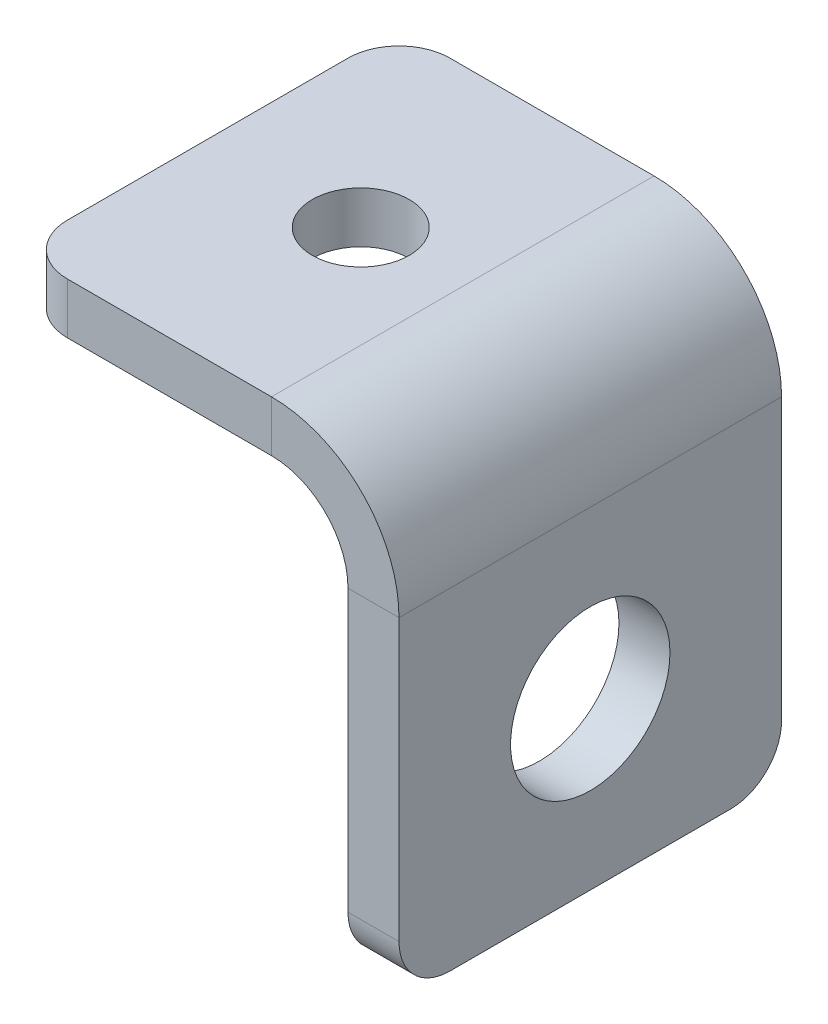
ISO-10303-21;
HEADER;
FILE_DESCRIPTION(('STEP AP214'),'2;1');
FILE_NAME('part.step','',(''),(''),'','','');
FILE_SCHEMA(('AUTOMOTIVE_DESIGN { 1 0 10303 214 1 1 1 1 }'));
ENDSEC;
DATA;
#1=APPLICATION_CONTEXT('core data for automotive mechanical design processes');
#2=APPLICATION_PROTOCOL_DEFINITION('international standard','automotive_design',2000,#1);
#3=PRODUCT_CONTEXT('',#1,'mechanical');
#4=PRODUCT('Part','Part','',(#3));
#5=PRODUCT_RELATED_PRODUCT_CATEGORY('part','',(#4));
#6=PRODUCT_DEFINITION_FORMATION('','',#4);
#7=PRODUCT_DEFINITION_CONTEXT('part definition',#1,'design');
#8=PRODUCT_DEFINITION('design','',#6,#7);
#9=PRODUCT_DEFINITION_SHAPE('','',#8);
#10=(LENGTH_UNIT() NAMED_UNIT(*) SI_UNIT(.MILLI.,.METRE.));
#11=(NAMED_UNIT(*) PLANE_ANGLE_UNIT() SI_UNIT($,.RADIAN.));
#12=(NAMED_UNIT(*) SI_UNIT($,.STERADIAN.) SOLID_ANGLE_UNIT());
#13=UNCERTAINTY_MEASURE_WITH_UNIT(LENGTH_MEASURE(1.E-05),#10,'distance_accuracy_value','');
#14=(GEOMETRIC_REPRESENTATION_CONTEXT(3) GLOBAL_UNCERTAINTY_ASSIGNED_CONTEXT((#13)) GLOBAL_UNIT_ASSIGNED_CONTEXT((#10,
#11,#12)) REPRESENTATION_CONTEXT('',''));
#15=CARTESIAN_POINT('',(0.,0.,0.));
#16=DIRECTION('',(0.,0.,1.));
#17=DIRECTION('',(1.,0.,0.));
#18=AXIS2_PLACEMENT_3D('',#15,#16,#17);
#19=CARTESIAN_POINT('',(2.54,0.,-6.985));
#20=DIRECTION('',(0.,-1.,0.));
#21=DIRECTION('',(0.,0.,-1.));
#22=AXIS2_PLACEMENT_3D('',#19,#20,#21);
#23=CYLINDRICAL_SURFACE('',#22,2.54);
#24=DIRECTION('',(0.,1.,0.));
#25=VECTOR('',#24,1.);
#26=CARTESIAN_POINT('',(2.54,0.,-9.525));
#27=LINE('',#26,#25);
#28=CARTESIAN_POINT('',(2.54,-2.54,-9.525));
#29=VERTEX_POINT('',#28);
#30=CARTESIAN_POINT('',(2.54,0.,-9.525));
#31=VERTEX_POINT('',#30);
#32=EDGE_CURVE('E11',#29,#31,#27,.T.);
#33=ORIENTED_EDGE('',*,*,#32,.F.);
#34=CARTESIAN_POINT('',(2.54,-2.54,-6.985));
#35=DIRECTION('',(0.,-1.,0.));
#36=DIRECTION('',(0.,0.,-1.));
#37=AXIS2_PLACEMENT_3D('',#34,#35,#36);
#38=CIRCLE('',#37,2.54);
#39=CARTESIAN_POINT('',(0.,-2.54,-6.98499999999999));
#40=VERTEX_POINT('',#39);
#41=EDGE_CURVE('E132',#29,#40,#38,.F.);
#42=ORIENTED_EDGE('',*,*,#41,.T.);
#43=DIRECTION('',(0.,1.,0.));
#44=VECTOR('',#43,1.);
#45=CARTESIAN_POINT('',(0.,0.,-6.98499999999999));
#46=LINE('',#45,#44);
#47=CARTESIAN_POINT('',(0.,0.,-6.98499999999999));
#48=VERTEX_POINT('',#47);
#49=EDGE_CURVE('E45',#40,#48,#46,.T.);
#50=ORIENTED_EDGE('',*,*,#49,.T.);
#51=CARTESIAN_POINT('',(2.54,0.,-6.985));
#52=DIRECTION('',(0.,-1.,0.));
#53=DIRECTION('',(0.,0.,-1.));
#54=AXIS2_PLACEMENT_3D('',#51,#52,#53);
#55=CIRCLE('',#54,2.54);
#56=EDGE_CURVE('E195',#31,#48,#55,.F.);
#57=ORIENTED_EDGE('',*,*,#56,.F.);
#58=EDGE_LOOP('',(#33,#42,#50,#57));
#59=FACE_BOUND('',#58,.T.);
#60=ADVANCED_FACE('F35',(#59),#23,.T.);
#61=CARTESIAN_POINT('',(0.,0.,9.525));
#62=DIRECTION('',(-1.,0.,0.));
#63=DIRECTION('',(0.,0.,-1.));
#64=AXIS2_PLACEMENT_3D('',#61,#62,#63);
#65=PLANE('',#64);
#66=ORIENTED_EDGE('',*,*,#49,.F.);
#67=DIRECTION('',(0.,0.,-1.));
#68=VECTOR('',#67,1.);
#69=CARTESIAN_POINT('',(0.,-2.54,9.525));
#70=LINE('',#69,#68);
#71=CARTESIAN_POINT('',(0.,-2.54,6.985));
#72=VERTEX_POINT('',#71);
#73=EDGE_CURVE('E161',#72,#40,#70,.T.);
#74=ORIENTED_EDGE('',*,*,#73,.F.);
#75=DIRECTION('',(0.,1.,0.));
#76=VECTOR('',#75,1.);
#77=CARTESIAN_POINT('',(0.,0.,6.985));
#78=LINE('',#77,#76);
#79=CARTESIAN_POINT('',(0.,0.,6.985));
#80=VERTEX_POINT('',#79);
#81=EDGE_CURVE('E188',#72,#80,#78,.T.);
#82=ORIENTED_EDGE('',*,*,#81,.T.);
#83=DIRECTION('',(0.,0.,-1.));
#84=VECTOR('',#83,1.);
#85=CARTESIAN_POINT('',(0.,0.,9.525));
#86=LINE('',#85,#84);
#87=EDGE_CURVE('E205',#80,#48,#86,.T.);
#88=ORIENTED_EDGE('',*,*,#87,.T.);
#89=EDGE_LOOP('',(#66,#74,#82,#88));
#90=FACE_BOUND('',#89,.T.);
#91=ADVANCED_FACE('F209',(#90),#65,.T.);
#92=CARTESIAN_POINT('',(2.54,0.,6.985));
#93=DIRECTION('',(0.,-1.,0.));
#94=DIRECTION('',(0.,0.,-1.));
#95=AXIS2_PLACEMENT_3D('',#92,#93,#94);
#96=CYLINDRICAL_SURFACE('',#95,2.54);
#97=ORIENTED_EDGE('',*,*,#81,.F.);
#98=CARTESIAN_POINT('',(2.54,-2.54,6.985));
#99=DIRECTION('',(0.,-1.,0.));
#100=DIRECTION('',(0.,0.,-1.));
#101=AXIS2_PLACEMENT_3D('',#98,#99,#100);
#102=CIRCLE('',#101,2.54);
#103=CARTESIAN_POINT('',(2.54,-2.54,9.525));
#104=VERTEX_POINT('',#103);
#105=EDGE_CURVE('E158',#72,#104,#102,.F.);
#106=ORIENTED_EDGE('',*,*,#105,.T.);
#107=DIRECTION('',(0.,1.,0.));
#108=VECTOR('',#107,1.);
#109=CARTESIAN_POINT('',(2.54,0.,9.525));
#110=LINE('',#109,#108);
#111=CARTESIAN_POINT('',(2.54,0.,9.525));
#112=VERTEX_POINT('',#111);
#113=EDGE_CURVE('E185',#104,#112,#110,.T.);
#114=ORIENTED_EDGE('',*,*,#113,.T.);
#115=CARTESIAN_POINT('',(2.54,0.,6.985));
#116=DIRECTION('',(0.,-1.,0.));
#117=DIRECTION('',(0.,0.,-1.));
#118=AXIS2_PLACEMENT_3D('',#115,#116,#117);
#119=CIRCLE('',#118,2.54);
#120=EDGE_CURVE('E210',#80,#112,#119,.F.);
#121=ORIENTED_EDGE('',*,*,#120,.F.);
#122=EDGE_LOOP('',(#97,#106,#114,#121));
#123=FACE_BOUND('',#122,.T.);
#124=ADVANCED_FACE('F298',(#123),#96,.T.);
#125=CARTESIAN_POINT('',(0.,0.,9.525));
#126=DIRECTION('',(0.,0.,1.));
#127=DIRECTION('',(-1.,0.,0.));
#128=AXIS2_PLACEMENT_3D('',#125,#126,#127);
#129=PLANE('',#128);
#130=ORIENTED_EDGE('',*,*,#113,.F.);
#131=DIRECTION('',(1.,0.,0.));
#132=VECTOR('',#131,1.);
#133=CARTESIAN_POINT('',(0.,-2.54,9.525));
#134=LINE('',#133,#132);
#135=CARTESIAN_POINT('',(12.7,-2.54,9.525));
#136=VERTEX_POINT('',#135);
#137=EDGE_CURVE('E128',#136,#104,#134,.F.);
#138=ORIENTED_EDGE('',*,*,#137,.F.);
#139=DIRECTION('',(0.,1.,0.));
#140=VECTOR('',#139,1.);
#141=CARTESIAN_POINT('',(12.7,0.,9.525));
#142=LINE('',#141,#140);
#143=CARTESIAN_POINT('',(12.7,0.,9.525));
#144=VERTEX_POINT('',#143);
#145=EDGE_CURVE('E182',#136,#144,#142,.T.);
#146=ORIENTED_EDGE('',*,*,#145,.T.);
#147=DIRECTION('',(-1.,0.,0.));
#148=VECTOR('',#147,1.);
#149=CARTESIAN_POINT('',(0.,0.,9.525));
#150=LINE('',#149,#148);
#151=EDGE_CURVE('E212',#144,#112,#150,.T.);
#152=ORIENTED_EDGE('',*,*,#151,.T.);
#153=EDGE_LOOP('',(#130,#138,#146,#152));
#154=FACE_BOUND('',#153,.T.);
#155=ADVANCED_FACE('F427',(#154),#129,.T.);
#156=CARTESIAN_POINT('',(12.7,-6.35,9.525));
#157=DIRECTION('',(0.,0.,-1.));
#158=DIRECTION('',(-1.,0.,0.));
#159=AXIS2_PLACEMENT_3D('',#156,#157,#158);
#160=PLANE('',#159);
#161=ORIENTED_EDGE('',*,*,#145,.F.);
#162=CARTESIAN_POINT('',(12.7,-6.35,9.525));
#163=DIRECTION('',(0.,0.,-1.));
#164=DIRECTION('',(-1.,0.,0.));
#165=AXIS2_PLACEMENT_3D('',#162,#163,#164);
#166=CIRCLE('',#165,3.81);
#167=CARTESIAN_POINT('',(16.51,-6.35,9.525));
#168=VERTEX_POINT('',#167);
#169=EDGE_CURVE('E124',#168,#136,#166,.F.);
#170=ORIENTED_EDGE('',*,*,#169,.F.);
#171=DIRECTION('',(1.,0.,0.));
#172=VECTOR('',#171,1.);
#173=CARTESIAN_POINT('',(19.05,-6.35,9.525));
#174=LINE('',#173,#172);
#175=CARTESIAN_POINT('',(19.05,-6.35,9.525));
#176=VERTEX_POINT('',#175);
#177=EDGE_CURVE('E179',#168,#176,#174,.T.);
#178=ORIENTED_EDGE('',*,*,#177,.T.);
#179=CARTESIAN_POINT('',(12.7,-6.35,9.525));
#180=DIRECTION('',(0.,0.,1.));
#181=DIRECTION('',(-1.,0.,0.));
#182=AXIS2_PLACEMENT_3D('',#179,#180,#181);
#183=CIRCLE('',#182,6.35);
#184=EDGE_CURVE('E113',#176,#144,#183,.T.);
#185=ORIENTED_EDGE('',*,*,#184,.T.);
#186=EDGE_LOOP('',(#161,#170,#178,#185));
#187=FACE_BOUND('',#186,.T.);
#188=ADVANCED_FACE('F248',(#187),#160,.F.);
#189=CARTESIAN_POINT('',(19.05,-6.35,9.525));
#190=DIRECTION('',(0.,0.,1.));
#191=DIRECTION('',(0.,1.,0.));
#192=AXIS2_PLACEMENT_3D('',#189,#190,#191);
#193=PLANE('',#192);
#194=ORIENTED_EDGE('',*,*,#177,.F.);
#195=DIRECTION('',(0.,1.,0.));
#196=VECTOR('',#195,1.);
#197=CARTESIAN_POINT('',(16.51,-6.35,9.525));
#198=LINE('',#197,#196);
#199=CARTESIAN_POINT('',(16.51,-20.32,9.525));
#200=VERTEX_POINT('',#199);
#201=EDGE_CURVE('E141',#200,#168,#198,.T.);
#202=ORIENTED_EDGE('',*,*,#201,.F.);
#203=DIRECTION('',(1.,0.,0.));
#204=VECTOR('',#203,1.);
#205=CARTESIAN_POINT('',(19.05,-20.32,9.525));
#206=LINE('',#205,#204);
#207=CARTESIAN_POINT('',(19.05,-20.32,9.525));
#208=VERTEX_POINT('',#207);
#209=EDGE_CURVE('E177',#200,#208,#206,.T.);
#210=ORIENTED_EDGE('',*,*,#209,.T.);
#211=DIRECTION('',(0.,1.,0.));
#212=VECTOR('',#211,1.);
#213=CARTESIAN_POINT('',(19.05,-6.35,9.525));
#214=LINE('',#213,#212);
#215=EDGE_CURVE('E236',#208,#176,#214,.T.);
#216=ORIENTED_EDGE('',*,*,#215,.T.);
#217=EDGE_LOOP('',(#194,#202,#210,#216));
#218=FACE_BOUND('',#217,.T.);
#219=ADVANCED_FACE('F281',(#218),#193,.T.);
#220=CARTESIAN_POINT('',(19.05,-20.32,6.985));
#221=DIRECTION('',(-1.,0.,0.));
#222=DIRECTION('',(0.,0.,1.));
#223=AXIS2_PLACEMENT_3D('',#220,#221,#222);
#224=CYLINDRICAL_SURFACE('',#223,2.54);
#225=ORIENTED_EDGE('',*,*,#209,.F.);
#226=CARTESIAN_POINT('',(16.51,-20.32,6.985));
#227=DIRECTION('',(-1.,0.,0.));
#228=DIRECTION('',(0.,0.,1.));
#229=AXIS2_PLACEMENT_3D('',#226,#227,#228);
#230=CIRCLE('',#229,2.54);
#231=CARTESIAN_POINT('',(16.51,-22.86,6.985));
#232=VERTEX_POINT('',#231);
#233=EDGE_CURVE('E137',#200,#232,#230,.F.);
#234=ORIENTED_EDGE('',*,*,#233,.T.);
#235=DIRECTION('',(1.,0.,0.));
#236=VECTOR('',#235,1.);
#237=CARTESIAN_POINT('',(19.05,-22.86,6.985));
#238=LINE('',#237,#236);
#239=CARTESIAN_POINT('',(19.05,-22.86,6.985));
#240=VERTEX_POINT('',#239);
#241=EDGE_CURVE('E53',#232,#240,#238,.T.);
#242=ORIENTED_EDGE('',*,*,#241,.T.);
#243=CARTESIAN_POINT('',(19.05,-20.32,6.985));
#244=DIRECTION('',(-1.,0.,0.));
#245=DIRECTION('',(0.,0.,1.));
#246=AXIS2_PLACEMENT_3D('',#243,#244,#245);
#247=CIRCLE('',#246,2.54);
#248=EDGE_CURVE('E239',#208,#240,#247,.F.);
#249=ORIENTED_EDGE('',*,*,#248,.F.);
#250=EDGE_LOOP('',(#225,#234,#242,#249));
#251=FACE_BOUND('',#250,.T.);
#252=ADVANCED_FACE('F282',(#251),#224,.T.);
#253=CARTESIAN_POINT('',(19.05,-22.86,9.525));
#254=DIRECTION('',(0.,1.,0.));
#255=DIRECTION('',(0.,0.,-1.));
#256=AXIS2_PLACEMENT_3D('',#253,#254,#255);
#257=PLANE('',#256);
#258=ORIENTED_EDGE('',*,*,#241,.F.);
#259=DIRECTION('',(0.,0.,1.));
#260=VECTOR('',#259,1.);
#261=CARTESIAN_POINT('',(16.51,-22.86,9.525));
#262=LINE('',#261,#260);
#263=CARTESIAN_POINT('',(16.51,-22.86,-6.98499999999999));
#264=VERTEX_POINT('',#263);
#265=EDGE_CURVE('E151',#232,#264,#262,.F.);
#266=ORIENTED_EDGE('',*,*,#265,.T.);
#267=DIRECTION('',(1.,0.,0.));
#268=VECTOR('',#267,1.);
#269=CARTESIAN_POINT('',(19.05,-22.86,-6.98499999999999));
#270=LINE('',#269,#268);
#271=CARTESIAN_POINT('',(19.05,-22.86,-6.98499999999999));
#272=VERTEX_POINT('',#271);
#273=EDGE_CURVE('E173',#264,#272,#270,.T.);
#274=ORIENTED_EDGE('',*,*,#273,.T.);
#275=DIRECTION('',(0.,0.,-1.));
#276=VECTOR('',#275,1.);
#277=CARTESIAN_POINT('',(19.05,-22.86,9.525));
#278=LINE('',#277,#276);
#279=EDGE_CURVE('E224',#240,#272,#278,.T.);
#280=ORIENTED_EDGE('',*,*,#279,.F.);
#281=EDGE_LOOP('',(#258,#266,#274,#280));
#282=FACE_BOUND('',#281,.T.);
#283=ADVANCED_FACE('F284',(#282),#257,.F.);
#284=CARTESIAN_POINT('',(19.05,-20.32,-6.985));
#285=DIRECTION('',(-1.,0.,0.));
#286=DIRECTION('',(0.,0.,1.));
#287=AXIS2_PLACEMENT_3D('',#284,#285,#286);
#288=CYLINDRICAL_SURFACE('',#287,2.54);
#289=ORIENTED_EDGE('',*,*,#273,.F.);
#290=CARTESIAN_POINT('',(16.51,-20.32,-6.985));
#291=DIRECTION('',(-1.,0.,0.));
#292=DIRECTION('',(0.,0.,1.));
#293=AXIS2_PLACEMENT_3D('',#290,#291,#292);
#294=CIRCLE('',#293,2.54);
#295=CARTESIAN_POINT('',(16.51,-20.32,-9.525));
#296=VERTEX_POINT('',#295);
#297=EDGE_CURVE('E148',#264,#296,#294,.F.);
#298=ORIENTED_EDGE('',*,*,#297,.T.);
#299=DIRECTION('',(1.,0.,0.));
#300=VECTOR('',#299,1.);
#301=CARTESIAN_POINT('',(19.05,-20.32,-9.525));
#302=LINE('',#301,#300);
#303=CARTESIAN_POINT('',(19.05,-20.32,-9.525));
#304=VERTEX_POINT('',#303);
#305=EDGE_CURVE('E170',#296,#304,#302,.T.);
#306=ORIENTED_EDGE('',*,*,#305,.T.);
#307=CARTESIAN_POINT('',(19.05,-20.32,-6.985));
#308=DIRECTION('',(-1.,0.,0.));
#309=DIRECTION('',(0.,0.,1.));
#310=AXIS2_PLACEMENT_3D('',#307,#308,#309);
#311=CIRCLE('',#310,2.54);
#312=EDGE_CURVE('E227',#272,#304,#311,.F.);
#313=ORIENTED_EDGE('',*,*,#312,.F.);
#314=EDGE_LOOP('',(#289,#298,#306,#313));
#315=FACE_BOUND('',#314,.T.);
#316=ADVANCED_FACE('F273',(#315),#288,.T.);
#317=CARTESIAN_POINT('',(19.05,-6.35,-9.525));
#318=DIRECTION('',(0.,0.,1.));
#319=DIRECTION('',(0.,1.,0.));
#320=AXIS2_PLACEMENT_3D('',#317,#318,#319);
#321=PLANE('',#320);
#322=ORIENTED_EDGE('',*,*,#305,.F.);
#323=DIRECTION('',(0.,1.,0.));
#324=VECTOR('',#323,1.);
#325=CARTESIAN_POINT('',(16.51,-6.35,-9.525));
#326=LINE('',#325,#324);
#327=CARTESIAN_POINT('',(16.51,-6.35,-9.525));
#328=VERTEX_POINT('',#327);
#329=EDGE_CURVE('E146',#296,#328,#326,.T.);
#330=ORIENTED_EDGE('',*,*,#329,.T.);
#331=DIRECTION('',(1.,0.,0.));
#332=VECTOR('',#331,1.);
#333=CARTESIAN_POINT('',(19.05,-6.35,-9.525));
#334=LINE('',#333,#332);
#335=CARTESIAN_POINT('',(19.05,-6.35,-9.525));
#336=VERTEX_POINT('',#335);
#337=EDGE_CURVE('E112',#328,#336,#334,.T.);
#338=ORIENTED_EDGE('',*,*,#337,.T.);
#339=DIRECTION('',(0.,1.,0.));
#340=VECTOR('',#339,1.);
#341=CARTESIAN_POINT('',(19.05,-6.35,-9.525));
#342=LINE('',#341,#340);
#343=EDGE_CURVE('E230',#304,#336,#342,.T.);
#344=ORIENTED_EDGE('',*,*,#343,.F.);
#345=EDGE_LOOP('',(#322,#330,#338,#344));
#346=FACE_BOUND('',#345,.T.);
#347=ADVANCED_FACE('F265',(#346),#321,.F.);
#348=CARTESIAN_POINT('',(12.7,-6.35,-9.525));
#349=DIRECTION('',(0.,0.,-1.));
#350=DIRECTION('',(-1.,0.,0.));
#351=AXIS2_PLACEMENT_3D('',#348,#349,#350);
#352=PLANE('',#351);
#353=ORIENTED_EDGE('',*,*,#337,.F.);
#354=CARTESIAN_POINT('',(12.7,-6.35,-9.52499999999999));
#355=DIRECTION('',(0.,0.,-1.));
#356=DIRECTION('',(-1.,0.,0.));
#357=AXIS2_PLACEMENT_3D('',#354,#355,#356);
#358=CIRCLE('',#357,3.81);
#359=CARTESIAN_POINT('',(12.7,-2.54,-9.525));
#360=VERTEX_POINT('',#359);
#361=EDGE_CURVE('E121',#328,#360,#358,.F.);
#362=ORIENTED_EDGE('',*,*,#361,.T.);
#363=DIRECTION('',(0.,1.,0.));
#364=VECTOR('',#363,1.);
#365=CARTESIAN_POINT('',(12.7,0.,-9.525));
#366=LINE('',#365,#364);
#367=CARTESIAN_POINT('',(12.7,0.,-9.525));
#368=VERTEX_POINT('',#367);
#369=EDGE_CURVE('E39',#360,#368,#366,.T.);
#370=ORIENTED_EDGE('',*,*,#369,.T.);
#371=CARTESIAN_POINT('',(12.7,-6.35,-9.525));
#372=DIRECTION('',(0.,0.,1.));
#373=DIRECTION('',(-1.,0.,0.));
#374=AXIS2_PLACEMENT_3D('',#371,#372,#373);
#375=CIRCLE('',#374,6.35);
#376=EDGE_CURVE('E241',#336,#368,#375,.T.);
#377=ORIENTED_EDGE('',*,*,#376,.F.);
#378=EDGE_LOOP('',(#353,#362,#370,#377));
#379=FACE_BOUND('',#378,.T.);
#380=ADVANCED_FACE('F134',(#379),#352,.T.);
#381=CARTESIAN_POINT('',(7.62,0.,0.));
#382=DIRECTION('',(0.,1.,0.));
#383=DIRECTION('',(0.,0.,1.));
#384=AXIS2_PLACEMENT_3D('',#381,#382,#383);
#385=CYLINDRICAL_SURFACE('',#384,2.413);
#386=CARTESIAN_POINT('',(7.62,0.,0.));
#387=DIRECTION('',(0.,1.,0.));
#388=DIRECTION('',(0.,0.,1.));
#389=AXIS2_PLACEMENT_3D('',#386,#387,#388);
#390=CIRCLE('',#389,2.413);
#391=CARTESIAN_POINT('',(7.62,0.,2.413));
#392=VERTEX_POINT('',#391);
#393=EDGE_CURVE('E139',#392,#392,#390,.T.);
#394=ORIENTED_EDGE('',*,*,#393,.T.);
#395=EDGE_LOOP('',(#394));
#396=FACE_BOUND('',#395,.T.);
#397=CARTESIAN_POINT('',(7.62,-2.54,0.));
#398=DIRECTION('',(0.,1.,0.));
#399=DIRECTION('',(0.,0.,1.));
#400=AXIS2_PLACEMENT_3D('',#397,#398,#399);
#401=CIRCLE('',#400,2.413);
#402=CARTESIAN_POINT('',(7.62,-2.54,2.413));
#403=VERTEX_POINT('',#402);
#404=EDGE_CURVE('E163',#403,#403,#401,.T.);
#405=ORIENTED_EDGE('',*,*,#404,.F.);
#406=EDGE_LOOP('',(#405));
#407=FACE_BOUND('',#406,.T.);
#408=ADVANCED_FACE('F37',(#396,#407),#385,.F.);
#409=CARTESIAN_POINT('',(19.05,-14.605,0.));
#410=DIRECTION('',(1.,0.,0.));
#411=DIRECTION('',(0.,0.,-1.));
#412=AXIS2_PLACEMENT_3D('',#409,#410,#411);
#413=CYLINDRICAL_SURFACE('',#412,3.96875);
#414=CARTESIAN_POINT('',(19.05,-14.605,0.));
#415=DIRECTION('',(1.,0.,0.));
#416=DIRECTION('',(0.,0.,-1.));
#417=AXIS2_PLACEMENT_3D('',#414,#415,#416);
#418=CIRCLE('',#417,3.96875);
#419=CARTESIAN_POINT('',(19.05,-14.605,-3.96875));
#420=VERTEX_POINT('',#419);
#421=EDGE_CURVE('E207',#420,#420,#418,.T.);
#422=ORIENTED_EDGE('',*,*,#421,.T.);
#423=EDGE_LOOP('',(#422));
#424=FACE_BOUND('',#423,.T.);
#425=CARTESIAN_POINT('',(16.51,-14.605,0.));
#426=DIRECTION('',(1.,0.,0.));
#427=DIRECTION('',(0.,0.,-1.));
#428=AXIS2_PLACEMENT_3D('',#425,#426,#427);
#429=CIRCLE('',#428,3.96875);
#430=CARTESIAN_POINT('',(16.51,-14.605,-3.96875));
#431=VERTEX_POINT('',#430);
#432=EDGE_CURVE('E153',#431,#431,#429,.T.);
#433=ORIENTED_EDGE('',*,*,#432,.F.);
#434=EDGE_LOOP('',(#433));
#435=FACE_BOUND('',#434,.T.);
#436=ADVANCED_FACE('F303',(#424,#435),#413,.F.);
#437=CARTESIAN_POINT('',(0.,0.,-9.525));
#438=DIRECTION('',(0.,0.,1.));
#439=DIRECTION('',(-1.,0.,0.));
#440=AXIS2_PLACEMENT_3D('',#437,#438,#439);
#441=PLANE('',#440);
#442=DIRECTION('',(1.,0.,0.));
#443=VECTOR('',#442,1.);
#444=CARTESIAN_POINT('',(0.,-2.54,-9.525));
#445=LINE('',#444,#443);
#446=EDGE_CURVE('E103',#360,#29,#445,.F.);
#447=ORIENTED_EDGE('',*,*,#446,.T.);
#448=ORIENTED_EDGE('',*,*,#32,.T.);
#449=DIRECTION('',(-1.,0.,0.));
#450=VECTOR('',#449,1.);
#451=CARTESIAN_POINT('',(0.,0.,-9.525));
#452=LINE('',#451,#450);
#453=EDGE_CURVE('E106',#368,#31,#452,.T.);
#454=ORIENTED_EDGE('',*,*,#453,.F.);
#455=ORIENTED_EDGE('',*,*,#369,.F.);
#456=EDGE_LOOP('',(#447,#448,#454,#455));
#457=FACE_BOUND('',#456,.T.);
#458=ADVANCED_FACE('F101',(#457),#441,.F.);
#459=CARTESIAN_POINT('',(12.7,-6.35,9.525));
#460=DIRECTION('',(0.,0.,-1.));
#461=DIRECTION('',(-1.,0.,0.));
#462=AXIS2_PLACEMENT_3D('',#459,#460,#461);
#463=CYLINDRICAL_SURFACE('',#462,6.35);
#464=ORIENTED_EDGE('',*,*,#376,.T.);
#465=DIRECTION('',(0.,0.,-1.));
#466=VECTOR('',#465,1.);
#467=CARTESIAN_POINT('',(12.7,0.,9.525));
#468=LINE('',#467,#466);
#469=EDGE_CURVE('E219',#144,#368,#468,.T.);
#470=ORIENTED_EDGE('',*,*,#469,.F.);
#471=ORIENTED_EDGE('',*,*,#184,.F.);
#472=DIRECTION('',(0.,0.,-1.));
#473=VECTOR('',#472,1.);
#474=CARTESIAN_POINT('',(19.05,-6.35,9.525));
#475=LINE('',#474,#473);
#476=EDGE_CURVE('E233',#176,#336,#475,.T.);
#477=ORIENTED_EDGE('',*,*,#476,.T.);
#478=EDGE_LOOP('',(#464,#470,#471,#477));
#479=FACE_BOUND('',#478,.T.);
#480=ADVANCED_FACE('F253',(#479),#463,.T.);
#481=CARTESIAN_POINT('',(19.05,-6.35,9.525));
#482=DIRECTION('',(-1.,0.,0.));
#483=DIRECTION('',(0.,0.,1.));
#484=AXIS2_PLACEMENT_3D('',#481,#482,#483);
#485=PLANE('',#484);
#486=ORIENTED_EDGE('',*,*,#421,.F.);
#487=EDGE_LOOP('',(#486));
#488=FACE_BOUND('',#487,.T.);
#489=ORIENTED_EDGE('',*,*,#279,.T.);
#490=ORIENTED_EDGE('',*,*,#312,.T.);
#491=ORIENTED_EDGE('',*,*,#343,.T.);
#492=ORIENTED_EDGE('',*,*,#476,.F.);
#493=ORIENTED_EDGE('',*,*,#215,.F.);
#494=ORIENTED_EDGE('',*,*,#248,.T.);
#495=EDGE_LOOP('',(#489,#490,#491,#492,#493,#494));
#496=FACE_BOUND('',#495,.T.);
#497=ADVANCED_FACE('F268',(#488,#496),#485,.F.);
#498=CARTESIAN_POINT('',(0.,0.,9.525));
#499=DIRECTION('',(0.,-1.,0.));
#500=DIRECTION('',(0.,0.,-1.));
#501=AXIS2_PLACEMENT_3D('',#498,#499,#500);
#502=PLANE('',#501);
#503=ORIENTED_EDGE('',*,*,#393,.F.);
#504=EDGE_LOOP('',(#503));
#505=FACE_BOUND('',#504,.T.);
#506=ORIENTED_EDGE('',*,*,#87,.F.);
#507=ORIENTED_EDGE('',*,*,#120,.T.);
#508=ORIENTED_EDGE('',*,*,#151,.F.);
#509=ORIENTED_EDGE('',*,*,#469,.T.);
#510=ORIENTED_EDGE('',*,*,#453,.T.);
#511=ORIENTED_EDGE('',*,*,#56,.T.);
#512=EDGE_LOOP('',(#506,#507,#508,#509,#510,#511));
#513=FACE_BOUND('',#512,.T.);
#514=ADVANCED_FACE('F203',(#505,#513),#502,.F.);
#515=CARTESIAN_POINT('',(12.7,-6.35,9.525));
#516=DIRECTION('',(0.,0.,-1.));
#517=DIRECTION('',(-1.,0.,0.));
#518=AXIS2_PLACEMENT_3D('',#515,#516,#517);
#519=CYLINDRICAL_SURFACE('',#518,3.81);
#520=ORIENTED_EDGE('',*,*,#361,.F.);
#521=DIRECTION('',(0.,0.,-1.));
#522=VECTOR('',#521,1.);
#523=CARTESIAN_POINT('',(16.51,-6.35,9.525));
#524=LINE('',#523,#522);
#525=EDGE_CURVE('E145',#168,#328,#524,.T.);
#526=ORIENTED_EDGE('',*,*,#525,.F.);
#527=ORIENTED_EDGE('',*,*,#169,.T.);
#528=DIRECTION('',(0.,0.,-1.));
#529=VECTOR('',#528,1.);
#530=CARTESIAN_POINT('',(12.7,-2.54,9.525));
#531=LINE('',#530,#529);
#532=EDGE_CURVE('E118',#136,#360,#531,.T.);
#533=ORIENTED_EDGE('',*,*,#532,.T.);
#534=EDGE_LOOP('',(#520,#526,#527,#533));
#535=FACE_BOUND('',#534,.T.);
#536=ADVANCED_FACE('F119',(#535),#519,.F.);
#537=CARTESIAN_POINT('',(16.51,-6.35,9.525));
#538=DIRECTION('',(-1.,0.,0.));
#539=DIRECTION('',(0.,0.,1.));
#540=AXIS2_PLACEMENT_3D('',#537,#538,#539);
#541=PLANE('',#540);
#542=ORIENTED_EDGE('',*,*,#432,.T.);
#543=EDGE_LOOP('',(#542));
#544=FACE_BOUND('',#543,.T.);
#545=ORIENTED_EDGE('',*,*,#265,.F.);
#546=ORIENTED_EDGE('',*,*,#233,.F.);
#547=ORIENTED_EDGE('',*,*,#201,.T.);
#548=ORIENTED_EDGE('',*,*,#525,.T.);
#549=ORIENTED_EDGE('',*,*,#329,.F.);
#550=ORIENTED_EDGE('',*,*,#297,.F.);
#551=EDGE_LOOP('',(#545,#546,#547,#548,#549,#550));
#552=FACE_BOUND('',#551,.T.);
#553=ADVANCED_FACE('F277',(#544,#552),#541,.T.);
#554=CARTESIAN_POINT('',(0.,-2.54,9.525));
#555=DIRECTION('',(0.,-1.,0.));
#556=DIRECTION('',(0.,0.,-1.));
#557=AXIS2_PLACEMENT_3D('',#554,#555,#556);
#558=PLANE('',#557);
#559=ORIENTED_EDGE('',*,*,#404,.T.);
#560=EDGE_LOOP('',(#559));
#561=FACE_BOUND('',#560,.T.);
#562=ORIENTED_EDGE('',*,*,#73,.T.);
#563=ORIENTED_EDGE('',*,*,#41,.F.);
#564=ORIENTED_EDGE('',*,*,#446,.F.);
#565=ORIENTED_EDGE('',*,*,#532,.F.);
#566=ORIENTED_EDGE('',*,*,#137,.T.);
#567=ORIENTED_EDGE('',*,*,#105,.F.);
#568=EDGE_LOOP('',(#562,#563,#564,#565,#566,#567));
#569=FACE_BOUND('',#568,.T.);
#570=ADVANCED_FACE('F131',(#561,#569),#558,.T.);
#571=CLOSED_SHELL('',(#60,#91,#124,#155,#188,#219,#252,#283,#316,#347,#380,#408,#436,#458,#480,
#497,#514,#536,#553,#570));
#572=MANIFOLD_SOLID_BREP('B2',#571);
#573=ADVANCED_BREP_SHAPE_REPRESENTATION('',(#18,#572),#14);
#574=SHAPE_DEFINITION_REPRESENTATION(#9,#573);
ENDSEC;
END-ISO-10303-21;
